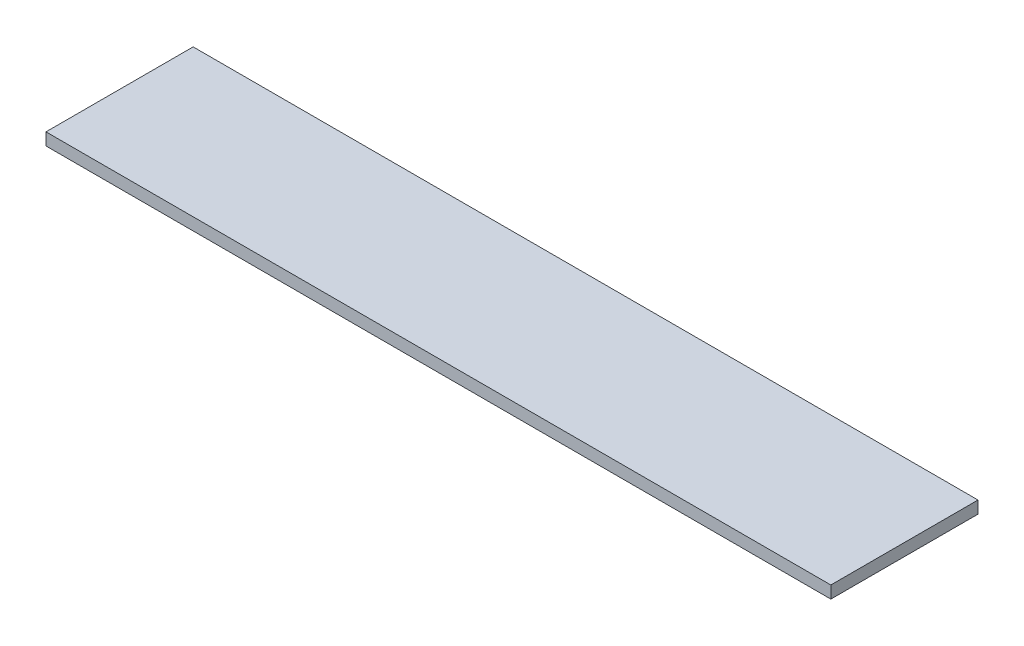
ISO-10303-21;
HEADER;
FILE_DESCRIPTION(('STEP AP214'),'2;1');
FILE_NAME('part.step','',(''),(''),'','','');
FILE_SCHEMA(('AUTOMOTIVE_DESIGN { 1 0 10303 214 1 1 1 1 }'));
ENDSEC;
DATA;
#1=APPLICATION_CONTEXT('core data for automotive mechanical design processes');
#2=APPLICATION_PROTOCOL_DEFINITION('international standard','automotive_design',2000,#1);
#3=PRODUCT_CONTEXT('',#1,'mechanical');
#4=PRODUCT('Part','Part','',(#3));
#5=PRODUCT_RELATED_PRODUCT_CATEGORY('part','',(#4));
#6=PRODUCT_DEFINITION_FORMATION('','',#4);
#7=PRODUCT_DEFINITION_CONTEXT('part definition',#1,'design');
#8=PRODUCT_DEFINITION('design','',#6,#7);
#9=PRODUCT_DEFINITION_SHAPE('','',#8);
#10=(LENGTH_UNIT() NAMED_UNIT(*) SI_UNIT(.MILLI.,.METRE.));
#11=(NAMED_UNIT(*) PLANE_ANGLE_UNIT() SI_UNIT($,.RADIAN.));
#12=(NAMED_UNIT(*) SI_UNIT($,.STERADIAN.) SOLID_ANGLE_UNIT());
#13=UNCERTAINTY_MEASURE_WITH_UNIT(LENGTH_MEASURE(1.E-05),#10,'distance_accuracy_value','');
#14=(GEOMETRIC_REPRESENTATION_CONTEXT(3) GLOBAL_UNCERTAINTY_ASSIGNED_CONTEXT((#13)) GLOBAL_UNIT_ASSIGNED_CONTEXT((#10,
#11,#12)) REPRESENTATION_CONTEXT('',''));
#15=CARTESIAN_POINT('',(0.,0.,0.));
#16=DIRECTION('',(0.,0.,1.));
#17=DIRECTION('',(1.,0.,0.));
#18=AXIS2_PLACEMENT_3D('',#15,#16,#17);
#19=CARTESIAN_POINT('',(0.,6.35000000000008,0.));
#20=DIRECTION('',(1.,0.,0.));
#21=DIRECTION('',(0.,0.,-1.));
#22=AXIS2_PLACEMENT_3D('',#19,#20,#21);
#23=PLANE('',#22);
#24=DIRECTION('',(0.,0.,1.));
#25=VECTOR('',#24,1.);
#26=CARTESIAN_POINT('',(0.,0.,0.));
#27=LINE('',#26,#25);
#28=CARTESIAN_POINT('',(0.,0.,-76.2));
#29=VERTEX_POINT('',#28);
#30=CARTESIAN_POINT('',(0.,0.,0.));
#31=VERTEX_POINT('',#30);
#32=EDGE_CURVE('E100',#29,#31,#27,.T.);
#33=ORIENTED_EDGE('',*,*,#32,.T.);
#34=DIRECTION('',(0.,-1.,0.));
#35=VECTOR('',#34,1.);
#36=CARTESIAN_POINT('',(0.,6.35000000000008,0.));
#37=LINE('',#36,#35);
#38=CARTESIAN_POINT('',(0.,6.35000000000008,0.));
#39=VERTEX_POINT('',#38);
#40=EDGE_CURVE('E11',#39,#31,#37,.T.);
#41=ORIENTED_EDGE('',*,*,#40,.F.);
#42=DIRECTION('',(0.,0.,1.));
#43=VECTOR('',#42,1.);
#44=CARTESIAN_POINT('',(0.,6.35000000000008,0.));
#45=LINE('',#44,#43);
#46=CARTESIAN_POINT('',(0.,6.35000000000008,-76.2));
#47=VERTEX_POINT('',#46);
#48=EDGE_CURVE('E88',#47,#39,#45,.T.);
#49=ORIENTED_EDGE('',*,*,#48,.F.);
#50=DIRECTION('',(0.,-1.,0.));
#51=VECTOR('',#50,1.);
#52=CARTESIAN_POINT('',(0.,6.35000000000008,-76.2));
#53=LINE('',#52,#51);
#54=EDGE_CURVE('E96',#47,#29,#53,.T.);
#55=ORIENTED_EDGE('',*,*,#54,.T.);
#56=EDGE_LOOP('',(#33,#41,#49,#55));
#57=FACE_BOUND('',#56,.T.);
#58=ADVANCED_FACE('F37',(#57),#23,.F.);
#59=CARTESIAN_POINT('',(0.,6.35000000000008,0.));
#60=DIRECTION('',(0.,0.,-1.));
#61=DIRECTION('',(-1.,0.,0.));
#62=AXIS2_PLACEMENT_3D('',#59,#60,#61);
#63=PLANE('',#62);
#64=DIRECTION('',(1.,0.,0.));
#65=VECTOR('',#64,1.);
#66=CARTESIAN_POINT('',(0.,0.,0.));
#67=LINE('',#66,#65);
#68=CARTESIAN_POINT('',(406.4,0.,0.));
#69=VERTEX_POINT('',#68);
#70=EDGE_CURVE('E92',#31,#69,#67,.T.);
#71=ORIENTED_EDGE('',*,*,#70,.T.);
#72=DIRECTION('',(0.,-1.,0.));
#73=VECTOR('',#72,1.);
#74=CARTESIAN_POINT('',(406.4,6.35000000000008,0.));
#75=LINE('',#74,#73);
#76=CARTESIAN_POINT('',(406.4,6.35000000000008,0.));
#77=VERTEX_POINT('',#76);
#78=EDGE_CURVE('E45',#77,#69,#75,.T.);
#79=ORIENTED_EDGE('',*,*,#78,.F.);
#80=DIRECTION('',(1.,0.,0.));
#81=VECTOR('',#80,1.);
#82=CARTESIAN_POINT('',(0.,6.35000000000008,0.));
#83=LINE('',#82,#81);
#84=EDGE_CURVE('E83',#39,#77,#83,.T.);
#85=ORIENTED_EDGE('',*,*,#84,.F.);
#86=ORIENTED_EDGE('',*,*,#40,.T.);
#87=EDGE_LOOP('',(#71,#79,#85,#86));
#88=FACE_BOUND('',#87,.T.);
#89=ADVANCED_FACE('F91',(#88),#63,.F.);
#90=CARTESIAN_POINT('',(406.4,6.35000000000008,0.));
#91=DIRECTION('',(-1.,0.,0.));
#92=DIRECTION('',(0.,0.,1.));
#93=AXIS2_PLACEMENT_3D('',#90,#91,#92);
#94=PLANE('',#93);
#95=DIRECTION('',(0.,0.,-1.));
#96=VECTOR('',#95,1.);
#97=CARTESIAN_POINT('',(406.4,0.,0.));
#98=LINE('',#97,#96);
#99=CARTESIAN_POINT('',(406.4,0.,-76.2));
#100=VERTEX_POINT('',#99);
#101=EDGE_CURVE('E70',#69,#100,#98,.T.);
#102=ORIENTED_EDGE('',*,*,#101,.T.);
#103=DIRECTION('',(0.,-1.,0.));
#104=VECTOR('',#103,1.);
#105=CARTESIAN_POINT('',(406.4,6.35000000000008,-76.2));
#106=LINE('',#105,#104);
#107=CARTESIAN_POINT('',(406.4,6.35000000000008,-76.2));
#108=VERTEX_POINT('',#107);
#109=EDGE_CURVE('E93',#108,#100,#106,.T.);
#110=ORIENTED_EDGE('',*,*,#109,.F.);
#111=DIRECTION('',(0.,0.,-1.));
#112=VECTOR('',#111,1.);
#113=CARTESIAN_POINT('',(406.4,6.35000000000008,0.));
#114=LINE('',#113,#112);
#115=EDGE_CURVE('E86',#77,#108,#114,.T.);
#116=ORIENTED_EDGE('',*,*,#115,.F.);
#117=ORIENTED_EDGE('',*,*,#78,.T.);
#118=EDGE_LOOP('',(#102,#110,#116,#117));
#119=FACE_BOUND('',#118,.T.);
#120=ADVANCED_FACE('F94',(#119),#94,.F.);
#121=CARTESIAN_POINT('',(0.,6.35000000000008,-76.2));
#122=DIRECTION('',(0.,0.,1.));
#123=DIRECTION('',(1.,0.,0.));
#124=AXIS2_PLACEMENT_3D('',#121,#122,#123);
#125=PLANE('',#124);
#126=DIRECTION('',(-1.,0.,0.));
#127=VECTOR('',#126,1.);
#128=CARTESIAN_POINT('',(0.,0.,-76.2));
#129=LINE('',#128,#127);
#130=EDGE_CURVE('E76',#100,#29,#129,.T.);
#131=ORIENTED_EDGE('',*,*,#130,.T.);
#132=ORIENTED_EDGE('',*,*,#54,.F.);
#133=DIRECTION('',(-1.,0.,0.));
#134=VECTOR('',#133,1.);
#135=CARTESIAN_POINT('',(0.,6.35000000000008,-76.2));
#136=LINE('',#135,#134);
#137=EDGE_CURVE('E53',#108,#47,#136,.T.);
#138=ORIENTED_EDGE('',*,*,#137,.F.);
#139=ORIENTED_EDGE('',*,*,#109,.T.);
#140=EDGE_LOOP('',(#131,#132,#138,#139));
#141=FACE_BOUND('',#140,.T.);
#142=ADVANCED_FACE('F107',(#141),#125,.F.);
#143=CARTESIAN_POINT('',(0.,6.35000000000008,0.));
#144=DIRECTION('',(0.,-1.,0.));
#145=DIRECTION('',(0.,0.,-1.));
#146=AXIS2_PLACEMENT_3D('',#143,#144,#145);
#147=PLANE('',#146);
#148=ORIENTED_EDGE('',*,*,#48,.T.);
#149=ORIENTED_EDGE('',*,*,#84,.T.);
#150=ORIENTED_EDGE('',*,*,#115,.T.);
#151=ORIENTED_EDGE('',*,*,#137,.T.);
#152=EDGE_LOOP('',(#148,#149,#150,#151));
#153=FACE_BOUND('',#152,.T.);
#154=ADVANCED_FACE('F84',(#153),#147,.F.);
#155=CARTESIAN_POINT('',(0.,0.,0.));
#156=DIRECTION('',(0.,-1.,0.));
#157=DIRECTION('',(0.,0.,-1.));
#158=AXIS2_PLACEMENT_3D('',#155,#156,#157);
#159=PLANE('',#158);
#160=ORIENTED_EDGE('',*,*,#32,.F.);
#161=ORIENTED_EDGE('',*,*,#130,.F.);
#162=ORIENTED_EDGE('',*,*,#101,.F.);
#163=ORIENTED_EDGE('',*,*,#70,.F.);
#164=EDGE_LOOP('',(#160,#161,#162,#163));
#165=FACE_BOUND('',#164,.T.);
#166=ADVANCED_FACE('F110',(#165),#159,.T.);
#167=CLOSED_SHELL('',(#58,#89,#120,#142,#154,#166));
#168=MANIFOLD_SOLID_BREP('B2',#167);
#169=ADVANCED_BREP_SHAPE_REPRESENTATION('',(#18,#168),#14);
#170=SHAPE_DEFINITION_REPRESENTATION(#9,#169);
ENDSEC;
END-ISO-10303-21;
